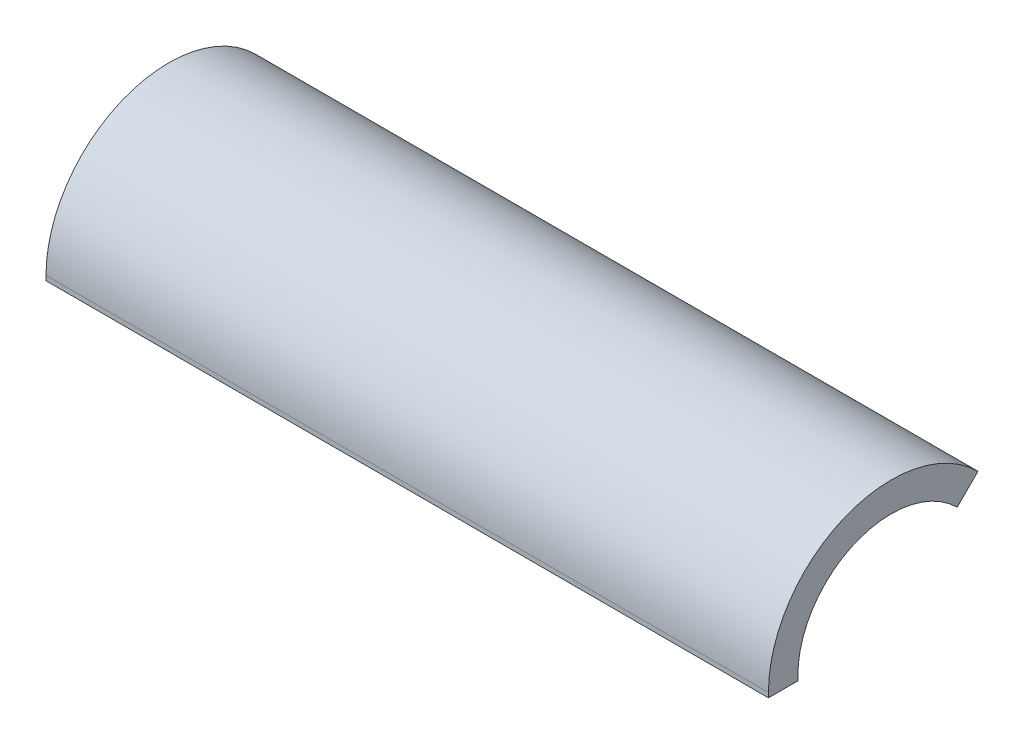
ISO-10303-21;
HEADER;
FILE_DESCRIPTION(('STEP AP214'),'2;1');
FILE_NAME('part.step','',(''),(''),'','','');
FILE_SCHEMA(('AUTOMOTIVE_DESIGN { 1 0 10303 214 1 1 1 1 }'));
ENDSEC;
DATA;
#1=APPLICATION_CONTEXT('core data for automotive mechanical design processes');
#2=APPLICATION_PROTOCOL_DEFINITION('international standard','automotive_design',2000,#1);
#3=PRODUCT_CONTEXT('',#1,'mechanical');
#4=PRODUCT('Part','Part','',(#3));
#5=PRODUCT_RELATED_PRODUCT_CATEGORY('part','',(#4));
#6=PRODUCT_DEFINITION_FORMATION('','',#4);
#7=PRODUCT_DEFINITION_CONTEXT('part definition',#1,'design');
#8=PRODUCT_DEFINITION('design','',#6,#7);
#9=PRODUCT_DEFINITION_SHAPE('','',#8);
#10=(LENGTH_UNIT() NAMED_UNIT(*) SI_UNIT(.MILLI.,.METRE.));
#11=(NAMED_UNIT(*) PLANE_ANGLE_UNIT() SI_UNIT($,.RADIAN.));
#12=(NAMED_UNIT(*) SI_UNIT($,.STERADIAN.) SOLID_ANGLE_UNIT());
#13=UNCERTAINTY_MEASURE_WITH_UNIT(LENGTH_MEASURE(1.E-05),#10,'distance_accuracy_value','');
#14=(GEOMETRIC_REPRESENTATION_CONTEXT(3) GLOBAL_UNCERTAINTY_ASSIGNED_CONTEXT((#13)) GLOBAL_UNIT_ASSIGNED_CONTEXT((#10,
#11,#12)) REPRESENTATION_CONTEXT('',''));
#15=CARTESIAN_POINT('',(0.,0.,0.));
#16=DIRECTION('',(0.,0.,1.));
#17=DIRECTION('',(1.,0.,0.));
#18=AXIS2_PLACEMENT_3D('',#15,#16,#17);
#19=CARTESIAN_POINT('',(98.298,0.,0.));
#20=DIRECTION('',(-1.,0.,0.));
#21=DIRECTION('',(0.,0.,1.));
#22=AXIS2_PLACEMENT_3D('',#19,#20,#21);
#23=CYLINDRICAL_SURFACE('',#22,16.7005);
#24=CARTESIAN_POINT('',(0.,0.,0.));
#25=DIRECTION('',(1.,0.,0.));
#26=DIRECTION('',(0.,0.,-1.));
#27=AXIS2_PLACEMENT_3D('',#24,#25,#26);
#28=CIRCLE('',#27,16.7005);
#29=CARTESIAN_POINT('',(0.,11.8090367992059,-11.809036799206));
#30=VERTEX_POINT('',#29);
#31=CARTESIAN_POINT('',(0.,0.,16.7005));
#32=VERTEX_POINT('',#31);
#33=EDGE_CURVE('E117',#30,#32,#28,.T.);
#34=ORIENTED_EDGE('',*,*,#33,.T.);
#35=DIRECTION('',(-1.,0.,0.));
#36=VECTOR('',#35,1.);
#37=CARTESIAN_POINT('',(98.298,0.,16.7005));
#38=LINE('',#37,#36);
#39=CARTESIAN_POINT('',(98.298,0.,16.7005));
#40=VERTEX_POINT('',#39);
#41=EDGE_CURVE('E11',#40,#32,#38,.T.);
#42=ORIENTED_EDGE('',*,*,#41,.F.);
#43=CARTESIAN_POINT('',(98.298,0.,0.));
#44=DIRECTION('',(1.,0.,0.));
#45=DIRECTION('',(0.,0.,-1.));
#46=AXIS2_PLACEMENT_3D('',#43,#44,#45);
#47=CIRCLE('',#46,16.7005);
#48=CARTESIAN_POINT('',(98.298,11.8090367992059,-11.809036799206));
#49=VERTEX_POINT('',#48);
#50=EDGE_CURVE('E75',#49,#40,#47,.T.);
#51=ORIENTED_EDGE('',*,*,#50,.F.);
#52=DIRECTION('',(-1.,0.,0.));
#53=VECTOR('',#52,1.);
#54=CARTESIAN_POINT('',(98.298,11.8090367992059,-11.809036799206));
#55=LINE('',#54,#53);
#56=EDGE_CURVE('E127',#49,#30,#55,.T.);
#57=ORIENTED_EDGE('',*,*,#56,.T.);
#58=EDGE_LOOP('',(#34,#42,#51,#57));
#59=FACE_BOUND('',#58,.T.);
#60=ADVANCED_FACE('F33',(#59),#23,.T.);
#61=CARTESIAN_POINT('',(98.298,0.,0.));
#62=DIRECTION('',(-1.,0.,0.));
#63=DIRECTION('',(0.,0.,1.));
#64=AXIS2_PLACEMENT_3D('',#61,#62,#63);
#65=CYLINDRICAL_SURFACE('',#64,12.7);
#66=CARTESIAN_POINT('',(0.,0.,0.));
#67=DIRECTION('',(-1.,0.,0.));
#68=DIRECTION('',(0.,0.,-1.));
#69=AXIS2_PLACEMENT_3D('',#66,#67,#68);
#70=CIRCLE('',#69,12.7);
#71=CARTESIAN_POINT('',(0.,0.,12.7));
#72=VERTEX_POINT('',#71);
#73=CARTESIAN_POINT('',(0.,8.98025612106911,-8.9802561210692));
#74=VERTEX_POINT('',#73);
#75=EDGE_CURVE('E64',#72,#74,#70,.T.);
#76=ORIENTED_EDGE('',*,*,#75,.T.);
#77=DIRECTION('',(-1.,0.,0.));
#78=VECTOR('',#77,1.);
#79=CARTESIAN_POINT('',(98.298,8.98025612106911,-8.9802561210692));
#80=LINE('',#79,#78);
#81=CARTESIAN_POINT('',(98.298,8.98025612106911,-8.9802561210692));
#82=VERTEX_POINT('',#81);
#83=EDGE_CURVE('E132',#82,#74,#80,.T.);
#84=ORIENTED_EDGE('',*,*,#83,.F.);
#85=CARTESIAN_POINT('',(98.298,0.,0.));
#86=DIRECTION('',(-1.,0.,0.));
#87=DIRECTION('',(0.,0.,-1.));
#88=AXIS2_PLACEMENT_3D('',#85,#86,#87);
#89=CIRCLE('',#88,12.7);
#90=CARTESIAN_POINT('',(98.298,0.,12.7));
#91=VERTEX_POINT('',#90);
#92=EDGE_CURVE('E125',#91,#82,#89,.T.);
#93=ORIENTED_EDGE('',*,*,#92,.F.);
#94=DIRECTION('',(-1.,0.,0.));
#95=VECTOR('',#94,1.);
#96=CARTESIAN_POINT('',(98.298,0.,12.7));
#97=LINE('',#96,#95);
#98=EDGE_CURVE('E41',#91,#72,#97,.T.);
#99=ORIENTED_EDGE('',*,*,#98,.T.);
#100=EDGE_LOOP('',(#76,#84,#93,#99));
#101=FACE_BOUND('',#100,.T.);
#102=ADVANCED_FACE('F133',(#101),#65,.F.);
#103=CARTESIAN_POINT('',(98.298,11.8090367992059,-11.809036799206));
#104=DIRECTION('',(0.,0.707106781186551,0.707106781186544));
#105=DIRECTION('',(0.,-0.707106781186544,0.707106781186551));
#106=AXIS2_PLACEMENT_3D('',#103,#104,#105);
#107=PLANE('',#106);
#108=DIRECTION('',(0.,0.707106781186544,-0.707106781186551));
#109=VECTOR('',#108,1.);
#110=CARTESIAN_POINT('',(0.,11.8090367992059,-11.809036799206));
#111=LINE('',#110,#109);
#112=EDGE_CURVE('E70',#74,#30,#111,.T.);
#113=ORIENTED_EDGE('',*,*,#112,.T.);
#114=ORIENTED_EDGE('',*,*,#56,.F.);
#115=DIRECTION('',(0.,0.707106781186544,-0.707106781186551));
#116=VECTOR('',#115,1.);
#117=CARTESIAN_POINT('',(98.298,11.8090367992059,-11.809036799206));
#118=LINE('',#117,#116);
#119=EDGE_CURVE('E49',#82,#49,#118,.T.);
#120=ORIENTED_EDGE('',*,*,#119,.F.);
#121=ORIENTED_EDGE('',*,*,#83,.T.);
#122=EDGE_LOOP('',(#113,#114,#120,#121));
#123=FACE_BOUND('',#122,.T.);
#124=ADVANCED_FACE('F143',(#123),#107,.F.);
#125=CARTESIAN_POINT('',(98.298,0.,0.));
#126=DIRECTION('',(1.,0.,0.));
#127=DIRECTION('',(0.,0.,-1.));
#128=AXIS2_PLACEMENT_3D('',#125,#126,#127);
#129=PLANE('',#128);
#130=ORIENTED_EDGE('',*,*,#50,.T.);
#131=DIRECTION('',(0.,1.,0.));
#132=VECTOR('',#131,1.);
#133=CARTESIAN_POINT('',(98.298,-0.635000000000002,16.7005));
#134=LINE('',#133,#132);
#135=CARTESIAN_POINT('',(98.298,-0.635000000000002,16.7005));
#136=VERTEX_POINT('',#135);
#137=EDGE_CURVE('E120',#136,#40,#134,.T.);
#138=ORIENTED_EDGE('',*,*,#137,.F.);
#139=DIRECTION('',(0.,0.,1.));
#140=VECTOR('',#139,1.);
#141=CARTESIAN_POINT('',(98.298,-0.635000000000002,12.7));
#142=LINE('',#141,#140);
#143=CARTESIAN_POINT('',(98.298,-0.635000000000002,12.7));
#144=VERTEX_POINT('',#143);
#145=EDGE_CURVE('E104',#144,#136,#142,.T.);
#146=ORIENTED_EDGE('',*,*,#145,.F.);
#147=DIRECTION('',(0.,1.,0.));
#148=VECTOR('',#147,1.);
#149=CARTESIAN_POINT('',(98.298,-0.635000000000002,12.7));
#150=LINE('',#149,#148);
#151=EDGE_CURVE('E101',#144,#91,#150,.T.);
#152=ORIENTED_EDGE('',*,*,#151,.T.);
#153=ORIENTED_EDGE('',*,*,#92,.T.);
#154=ORIENTED_EDGE('',*,*,#119,.T.);
#155=EDGE_LOOP('',(#130,#138,#146,#152,#153,#154));
#156=FACE_BOUND('',#155,.T.);
#157=ADVANCED_FACE('F134',(#156),#129,.T.);
#158=CARTESIAN_POINT('',(0.,0.,0.));
#159=DIRECTION('',(1.,0.,0.));
#160=DIRECTION('',(0.,0.,-1.));
#161=AXIS2_PLACEMENT_3D('',#158,#159,#160);
#162=PLANE('',#161);
#163=ORIENTED_EDGE('',*,*,#33,.F.);
#164=ORIENTED_EDGE('',*,*,#112,.F.);
#165=ORIENTED_EDGE('',*,*,#75,.F.);
#166=DIRECTION('',(0.,1.,0.));
#167=VECTOR('',#166,1.);
#168=CARTESIAN_POINT('',(0.,-0.635000000000002,12.7));
#169=LINE('',#168,#167);
#170=CARTESIAN_POINT('',(0.,-0.635000000000002,12.7));
#171=VERTEX_POINT('',#170);
#172=EDGE_CURVE('E99',#171,#72,#169,.T.);
#173=ORIENTED_EDGE('',*,*,#172,.F.);
#174=DIRECTION('',(0.,0.,-1.));
#175=VECTOR('',#174,1.);
#176=CARTESIAN_POINT('',(0.,-0.635000000000002,12.7));
#177=LINE('',#176,#175);
#178=CARTESIAN_POINT('',(0.,-0.635000000000002,16.7005));
#179=VERTEX_POINT('',#178);
#180=EDGE_CURVE('E105',#179,#171,#177,.T.);
#181=ORIENTED_EDGE('',*,*,#180,.F.);
#182=DIRECTION('',(0.,1.,0.));
#183=VECTOR('',#182,1.);
#184=CARTESIAN_POINT('',(0.,-0.635000000000002,16.7005));
#185=LINE('',#184,#183);
#186=EDGE_CURVE('E137',#179,#32,#185,.T.);
#187=ORIENTED_EDGE('',*,*,#186,.T.);
#188=EDGE_LOOP('',(#163,#164,#165,#173,#181,#187));
#189=FACE_BOUND('',#188,.T.);
#190=ADVANCED_FACE('F116',(#189),#162,.F.);
#191=CARTESIAN_POINT('',(0.,-0.635000000000002,12.7));
#192=DIRECTION('',(0.,0.,1.));
#193=DIRECTION('',(0.,-1.,0.));
#194=AXIS2_PLACEMENT_3D('',#191,#192,#193);
#195=PLANE('',#194);
#196=ORIENTED_EDGE('',*,*,#98,.F.);
#197=ORIENTED_EDGE('',*,*,#151,.F.);
#198=DIRECTION('',(1.,0.,0.));
#199=VECTOR('',#198,1.);
#200=CARTESIAN_POINT('',(0.,-0.635000000000002,12.7));
#201=LINE('',#200,#199);
#202=EDGE_CURVE('E94',#171,#144,#201,.T.);
#203=ORIENTED_EDGE('',*,*,#202,.F.);
#204=ORIENTED_EDGE('',*,*,#172,.T.);
#205=EDGE_LOOP('',(#196,#197,#203,#204));
#206=FACE_BOUND('',#205,.T.);
#207=ADVANCED_FACE('F97',(#206),#195,.F.);
#208=CARTESIAN_POINT('',(0.,-0.635000000000002,16.7005));
#209=DIRECTION('',(0.,0.,-1.));
#210=DIRECTION('',(0.,1.,0.));
#211=AXIS2_PLACEMENT_3D('',#208,#209,#210);
#212=PLANE('',#211);
#213=ORIENTED_EDGE('',*,*,#41,.T.);
#214=ORIENTED_EDGE('',*,*,#186,.F.);
#215=DIRECTION('',(-1.,0.,0.));
#216=VECTOR('',#215,1.);
#217=CARTESIAN_POINT('',(0.,-0.635000000000002,16.7005));
#218=LINE('',#217,#216);
#219=EDGE_CURVE('E110',#136,#179,#218,.T.);
#220=ORIENTED_EDGE('',*,*,#219,.F.);
#221=ORIENTED_EDGE('',*,*,#137,.T.);
#222=EDGE_LOOP('',(#213,#214,#220,#221));
#223=FACE_BOUND('',#222,.T.);
#224=ADVANCED_FACE('F141',(#223),#212,.F.);
#225=CARTESIAN_POINT('',(0.,-0.635,0.));
#226=DIRECTION('',(0.,1.,0.));
#227=DIRECTION('',(0.,0.,1.));
#228=AXIS2_PLACEMENT_3D('',#225,#226,#227);
#229=PLANE('',#228);
#230=ORIENTED_EDGE('',*,*,#180,.T.);
#231=ORIENTED_EDGE('',*,*,#202,.T.);
#232=ORIENTED_EDGE('',*,*,#145,.T.);
#233=ORIENTED_EDGE('',*,*,#219,.T.);
#234=EDGE_LOOP('',(#230,#231,#232,#233));
#235=FACE_BOUND('',#234,.T.);
#236=ADVANCED_FACE('F108',(#235),#229,.F.);
#237=CLOSED_SHELL('',(#60,#102,#124,#157,#190,#207,#224,#236));
#238=MANIFOLD_SOLID_BREP('B2',#237);
#239=ADVANCED_BREP_SHAPE_REPRESENTATION('',(#18,#238),#14);
#240=SHAPE_DEFINITION_REPRESENTATION(#9,#239);
ENDSEC;
END-ISO-10303-21;
